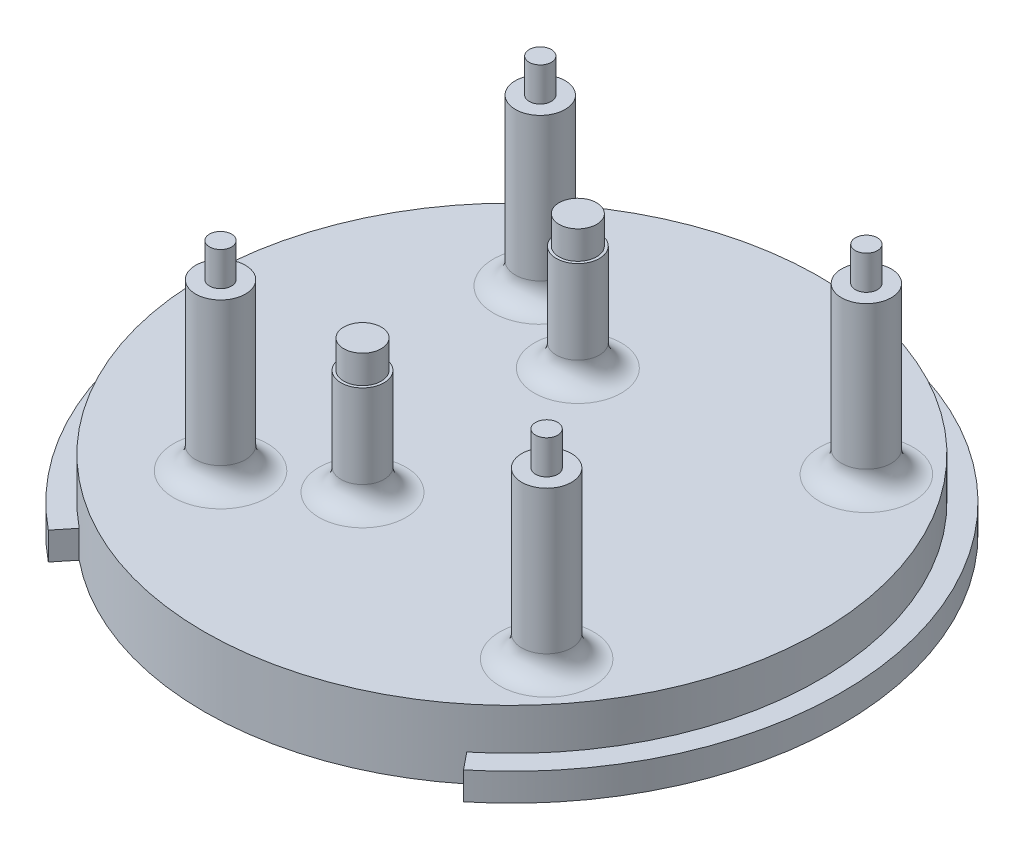
ISO-10303-21;
HEADER;
FILE_DESCRIPTION(('STEP AP214'),'2;1');
FILE_NAME('part.step','',(''),(''),'','','');
FILE_SCHEMA(('AUTOMOTIVE_DESIGN { 1 0 10303 214 1 1 1 1 }'));
ENDSEC;
DATA;
#1=APPLICATION_CONTEXT('core data for automotive mechanical design processes');
#2=APPLICATION_PROTOCOL_DEFINITION('international standard','automotive_design',2000,#1);
#3=PRODUCT_CONTEXT('',#1,'mechanical');
#4=PRODUCT('Part','Part','',(#3));
#5=PRODUCT_RELATED_PRODUCT_CATEGORY('part','',(#4));
#6=PRODUCT_DEFINITION_FORMATION('','',#4);
#7=PRODUCT_DEFINITION_CONTEXT('part definition',#1,'design');
#8=PRODUCT_DEFINITION('design','',#6,#7);
#9=PRODUCT_DEFINITION_SHAPE('','',#8);
#10=(LENGTH_UNIT() NAMED_UNIT(*) SI_UNIT(.MILLI.,.METRE.));
#11=(NAMED_UNIT(*) PLANE_ANGLE_UNIT() SI_UNIT($,.RADIAN.));
#12=(NAMED_UNIT(*) SI_UNIT($,.STERADIAN.) SOLID_ANGLE_UNIT());
#13=UNCERTAINTY_MEASURE_WITH_UNIT(LENGTH_MEASURE(1.E-05),#10,'distance_accuracy_value','');
#14=(GEOMETRIC_REPRESENTATION_CONTEXT(3) GLOBAL_UNCERTAINTY_ASSIGNED_CONTEXT((#13)) GLOBAL_UNIT_ASSIGNED_CONTEXT((#10,
#11,#12)) REPRESENTATION_CONTEXT('',''));
#15=CARTESIAN_POINT('',(0.,0.,0.));
#16=DIRECTION('',(0.,0.,1.));
#17=DIRECTION('',(1.,0.,0.));
#18=AXIS2_PLACEMENT_3D('',#15,#16,#17);
#19=CARTESIAN_POINT('',(0.,2.,0.));
#20=DIRECTION('',(0.,-1.,0.));
#21=DIRECTION('',(0.,0.,-1.));
#22=AXIS2_PLACEMENT_3D('',#19,#20,#21);
#23=CYLINDRICAL_SURFACE('',#22,23.8125);
#24=CARTESIAN_POINT('',(0.,0.,0.));
#25=DIRECTION('',(0.,1.,0.));
#26=DIRECTION('',(0.,0.,1.));
#27=AXIS2_PLACEMENT_3D('',#24,#25,#26);
#28=CIRCLE('',#27,23.8125);
#29=CARTESIAN_POINT('',(15.,0.,18.4941925006203));
#30=VERTEX_POINT('',#29);
#31=CARTESIAN_POINT('',(-15.,0.,18.4941925006203));
#32=VERTEX_POINT('',#31);
#33=EDGE_CURVE('E96',#30,#32,#28,.T.);
#34=ORIENTED_EDGE('',*,*,#33,.T.);
#35=DIRECTION('',(0.,1.,0.));
#36=VECTOR('',#35,1.);
#37=CARTESIAN_POINT('',(-15.,0.,18.4941925006203));
#38=LINE('',#37,#36);
#39=CARTESIAN_POINT('',(-15.,2.,18.4941925006203));
#40=VERTEX_POINT('',#39);
#41=EDGE_CURVE('E58',#32,#40,#38,.T.);
#42=ORIENTED_EDGE('',*,*,#41,.T.);
#43=CARTESIAN_POINT('',(0.,2.,0.));
#44=DIRECTION('',(0.,1.,0.));
#45=DIRECTION('',(0.,0.,1.));
#46=AXIS2_PLACEMENT_3D('',#43,#44,#45);
#47=CIRCLE('',#46,23.8125);
#48=CARTESIAN_POINT('',(15.,2.,18.4941925006203));
#49=VERTEX_POINT('',#48);
#50=EDGE_CURVE('E114',#49,#40,#47,.T.);
#51=ORIENTED_EDGE('',*,*,#50,.F.);
#52=DIRECTION('',(0.,1.,0.));
#53=VECTOR('',#52,1.);
#54=CARTESIAN_POINT('',(15.,0.,18.4941925006203));
#55=LINE('',#54,#53);
#56=EDGE_CURVE('E85',#30,#49,#55,.T.);
#57=ORIENTED_EDGE('',*,*,#56,.F.);
#58=EDGE_LOOP('',(#34,#42,#51,#57));
#59=FACE_BOUND('',#58,.T.);
#60=ADVANCED_FACE('F34',(#59),#23,.T.);
#61=CARTESIAN_POINT('',(0.,2.,0.));
#62=DIRECTION('',(0.,1.,0.));
#63=DIRECTION('',(0.,0.,1.));
#64=AXIS2_PLACEMENT_3D('',#61,#62,#63);
#65=PLANE('',#64);
#66=DIRECTION('',(-0.629921259842522,0.,0.776659002650719));
#67=VECTOR('',#66,1.);
#68=CARTESIAN_POINT('',(-15.,2.,18.4941925006203));
#69=LINE('',#68,#67);
#70=CARTESIAN_POINT('',(-14.,2.,17.2612463339123));
#71=VERTEX_POINT('',#70);
#72=EDGE_CURVE('E72',#71,#40,#69,.T.);
#73=ORIENTED_EDGE('',*,*,#72,.F.);
#74=CARTESIAN_POINT('',(0.,2.,0.));
#75=DIRECTION('',(0.,1.,0.));
#76=DIRECTION('',(0.,0.,1.));
#77=AXIS2_PLACEMENT_3D('',#74,#75,#76);
#78=CIRCLE('',#77,22.225);
#79=CARTESIAN_POINT('',(14.,2.,17.2612463339123));
#80=VERTEX_POINT('',#79);
#81=EDGE_CURVE('E111',#80,#71,#78,.T.);
#82=ORIENTED_EDGE('',*,*,#81,.F.);
#83=DIRECTION('',(-0.629921259842522,0.,-0.776659002650719));
#84=VECTOR('',#83,1.);
#85=CARTESIAN_POINT('',(15.,2.,18.4941925006203));
#86=LINE('',#85,#84);
#87=EDGE_CURVE('E49',#49,#80,#86,.T.);
#88=ORIENTED_EDGE('',*,*,#87,.F.);
#89=ORIENTED_EDGE('',*,*,#50,.T.);
#90=EDGE_LOOP('',(#73,#82,#88,#89));
#91=FACE_BOUND('',#90,.T.);
#92=ADVANCED_FACE('F168',(#91),#65,.T.);
#93=CARTESIAN_POINT('',(0.,0.,0.));
#94=DIRECTION('',(0.,1.,0.));
#95=DIRECTION('',(0.,0.,1.));
#96=AXIS2_PLACEMENT_3D('',#93,#94,#95);
#97=PLANE('',#96);
#98=CARTESIAN_POINT('',(0.,0.,0.));
#99=DIRECTION('',(0.,-1.,0.));
#100=DIRECTION('',(0.,0.,1.));
#101=AXIS2_PLACEMENT_3D('',#98,#99,#100);
#102=CIRCLE('',#101,22.225);
#103=CARTESIAN_POINT('',(14.,0.,17.2612463339123));
#104=VERTEX_POINT('',#103);
#105=CARTESIAN_POINT('',(-14.,0.,17.2612463339123));
#106=VERTEX_POINT('',#105);
#107=EDGE_CURVE('E88',#104,#106,#102,.T.);
#108=ORIENTED_EDGE('',*,*,#107,.T.);
#109=DIRECTION('',(-0.629921259842522,0.,0.776659002650719));
#110=VECTOR('',#109,1.);
#111=CARTESIAN_POINT('',(-15.,0.,18.4941925006203));
#112=LINE('',#111,#110);
#113=EDGE_CURVE('E91',#106,#32,#112,.T.);
#114=ORIENTED_EDGE('',*,*,#113,.T.);
#115=ORIENTED_EDGE('',*,*,#33,.F.);
#116=DIRECTION('',(-0.629921259842522,0.,-0.776659002650719));
#117=VECTOR('',#116,1.);
#118=CARTESIAN_POINT('',(15.,0.,18.4941925006203));
#119=LINE('',#118,#117);
#120=EDGE_CURVE('E76',#30,#104,#119,.T.);
#121=ORIENTED_EDGE('',*,*,#120,.T.);
#122=EDGE_LOOP('',(#108,#114,#115,#121));
#123=FACE_BOUND('',#122,.T.);
#124=ADVANCED_FACE('F94',(#123),#97,.F.);
#125=CARTESIAN_POINT('',(0.,5.,0.));
#126=DIRECTION('',(0.,-1.,0.));
#127=DIRECTION('',(0.,0.,-1.));
#128=AXIS2_PLACEMENT_3D('',#125,#126,#127);
#129=CYLINDRICAL_SURFACE('',#128,22.225);
#130=CARTESIAN_POINT('',(0.,5.,0.));
#131=DIRECTION('',(0.,1.,0.));
#132=DIRECTION('',(0.,0.,1.));
#133=AXIS2_PLACEMENT_3D('',#130,#131,#132);
#134=CIRCLE('',#133,22.225);
#135=CARTESIAN_POINT('',(0.,5.,22.225));
#136=VERTEX_POINT('',#135);
#137=EDGE_CURVE('E106',#136,#136,#134,.T.);
#138=ORIENTED_EDGE('',*,*,#137,.F.);
#139=EDGE_LOOP('',(#138));
#140=FACE_BOUND('',#139,.T.);
#141=ORIENTED_EDGE('',*,*,#81,.T.);
#142=DIRECTION('',(0.,1.,0.));
#143=VECTOR('',#142,1.);
#144=CARTESIAN_POINT('',(-14.,0.,17.2612463339123));
#145=LINE('',#144,#143);
#146=EDGE_CURVE('E84',#106,#71,#145,.T.);
#147=ORIENTED_EDGE('',*,*,#146,.F.);
#148=ORIENTED_EDGE('',*,*,#107,.F.);
#149=DIRECTION('',(0.,1.,0.));
#150=VECTOR('',#149,1.);
#151=CARTESIAN_POINT('',(14.,0.,17.2612463339123));
#152=LINE('',#151,#150);
#153=EDGE_CURVE('E78',#104,#80,#152,.T.);
#154=ORIENTED_EDGE('',*,*,#153,.T.);
#155=EDGE_LOOP('',(#141,#147,#148,#154));
#156=FACE_BOUND('',#155,.T.);
#157=ADVANCED_FACE('F89',(#140,#156),#129,.T.);
#158=CARTESIAN_POINT('',(0.,5.,0.));
#159=DIRECTION('',(0.,1.,0.));
#160=DIRECTION('',(0.,0.,1.));
#161=AXIS2_PLACEMENT_3D('',#158,#159,#160);
#162=PLANE('',#161);
#163=CARTESIAN_POINT('',(14.06,5.,-11.55));
#164=DIRECTION('',(0.,1.,0.));
#165=DIRECTION('',(0.,0.,1.));
#166=AXIS2_PLACEMENT_3D('',#163,#164,#165);
#167=CIRCLE('',#166,3.3875);
#168=CARTESIAN_POINT('',(14.06,5.,-8.16250000000002));
#169=VERTEX_POINT('',#168);
#170=EDGE_CURVE('E137',#169,#169,#167,.F.);
#171=ORIENTED_EDGE('',*,*,#170,.T.);
#172=EDGE_LOOP('',(#171));
#173=FACE_BOUND('',#172,.T.);
#174=CARTESIAN_POINT('',(14.06,5.,11.55));
#175=DIRECTION('',(0.,1.,0.));
#176=DIRECTION('',(0.,0.,1.));
#177=AXIS2_PLACEMENT_3D('',#174,#175,#176);
#178=CIRCLE('',#177,3.3875);
#179=CARTESIAN_POINT('',(14.06,5.,14.9375));
#180=VERTEX_POINT('',#179);
#181=EDGE_CURVE('E134',#180,#180,#178,.F.);
#182=ORIENTED_EDGE('',*,*,#181,.T.);
#183=EDGE_LOOP('',(#182));
#184=FACE_BOUND('',#183,.T.);
#185=CARTESIAN_POINT('',(-3.01475000000002,5.,7.77874999999997));
#186=DIRECTION('',(0.,1.,0.));
#187=DIRECTION('',(0.,0.,1.));
#188=AXIS2_PLACEMENT_3D('',#185,#186,#187);
#189=CIRCLE('',#188,3.14325);
#190=CARTESIAN_POINT('',(-3.01475000000002,5.,10.922));
#191=VERTEX_POINT('',#190);
#192=EDGE_CURVE('E131',#191,#191,#189,.F.);
#193=ORIENTED_EDGE('',*,*,#192,.T.);
#194=EDGE_LOOP('',(#193));
#195=FACE_BOUND('',#194,.T.);
#196=CARTESIAN_POINT('',(-3.01475000000002,5.,-7.77875000000002));
#197=DIRECTION('',(0.,1.,0.));
#198=DIRECTION('',(0.,0.,1.));
#199=AXIS2_PLACEMENT_3D('',#196,#197,#198);
#200=CIRCLE('',#199,3.14325);
#201=CARTESIAN_POINT('',(-3.01475000000002,5.,-4.63550000000003));
#202=VERTEX_POINT('',#201);
#203=EDGE_CURVE('E128',#202,#202,#200,.F.);
#204=ORIENTED_EDGE('',*,*,#203,.T.);
#205=EDGE_LOOP('',(#204));
#206=FACE_BOUND('',#205,.T.);
#207=CARTESIAN_POINT('',(-9.50000000000001,5.,-11.55));
#208=DIRECTION('',(0.,1.,0.));
#209=DIRECTION('',(0.,0.,1.));
#210=AXIS2_PLACEMENT_3D('',#207,#208,#209);
#211=CIRCLE('',#210,3.3875);
#212=CARTESIAN_POINT('',(-9.50000000000001,5.,-8.16250000000003));
#213=VERTEX_POINT('',#212);
#214=EDGE_CURVE('E125',#213,#213,#211,.F.);
#215=ORIENTED_EDGE('',*,*,#214,.T.);
#216=EDGE_LOOP('',(#215));
#217=FACE_BOUND('',#216,.T.);
#218=CARTESIAN_POINT('',(-9.50000000000001,5.,11.55));
#219=DIRECTION('',(0.,1.,0.));
#220=DIRECTION('',(0.,0.,1.));
#221=AXIS2_PLACEMENT_3D('',#218,#219,#220);
#222=CIRCLE('',#221,3.3875);
#223=CARTESIAN_POINT('',(-9.50000000000001,5.,14.9375));
#224=VERTEX_POINT('',#223);
#225=EDGE_CURVE('E121',#224,#224,#222,.F.);
#226=ORIENTED_EDGE('',*,*,#225,.T.);
#227=EDGE_LOOP('',(#226));
#228=FACE_BOUND('',#227,.T.);
#229=ORIENTED_EDGE('',*,*,#137,.T.);
#230=EDGE_LOOP('',(#229));
#231=FACE_BOUND('',#230,.T.);
#232=ADVANCED_FACE('F243',(#173,#184,#195,#206,#217,#228,#231),#162,.T.);
#233=CARTESIAN_POINT('',(-15.,0.,18.4941925006203));
#234=DIRECTION('',(-0.776659002650719,0.,-0.629921259842522));
#235=DIRECTION('',(-0.629921259842522,0.,0.77665900265072));
#236=AXIS2_PLACEMENT_3D('',#233,#234,#235);
#237=PLANE('',#236);
#238=ORIENTED_EDGE('',*,*,#72,.T.);
#239=ORIENTED_EDGE('',*,*,#41,.F.);
#240=ORIENTED_EDGE('',*,*,#113,.F.);
#241=ORIENTED_EDGE('',*,*,#146,.T.);
#242=EDGE_LOOP('',(#238,#239,#240,#241));
#243=FACE_BOUND('',#242,.T.);
#244=ADVANCED_FACE('F240',(#243),#237,.F.);
#245=CARTESIAN_POINT('',(15.,0.,18.4941925006203));
#246=DIRECTION('',(0.776659002650719,0.,-0.629921259842522));
#247=DIRECTION('',(-0.629921259842522,0.,-0.77665900265072));
#248=AXIS2_PLACEMENT_3D('',#245,#246,#247);
#249=PLANE('',#248);
#250=ORIENTED_EDGE('',*,*,#87,.T.);
#251=ORIENTED_EDGE('',*,*,#153,.F.);
#252=ORIENTED_EDGE('',*,*,#120,.F.);
#253=ORIENTED_EDGE('',*,*,#56,.T.);
#254=EDGE_LOOP('',(#250,#251,#252,#253));
#255=FACE_BOUND('',#254,.T.);
#256=ADVANCED_FACE('F80',(#255),#249,.F.);
#257=CARTESIAN_POINT('',(-9.50000000000001,22.0411688245432,-11.55));
#258=DIRECTION('',(0.,-1.,0.));
#259=DIRECTION('',(0.,0.,-1.));
#260=AXIS2_PLACEMENT_3D('',#257,#258,#259);
#261=CYLINDRICAL_SURFACE('',#260,1.8);
#262=CARTESIAN_POINT('',(-9.50000000000001,6.5875,-11.55));
#263=DIRECTION('',(0.,1.,0.));
#264=DIRECTION('',(0.,0.,1.));
#265=AXIS2_PLACEMENT_3D('',#262,#263,#264);
#266=CIRCLE('',#265,1.8);
#267=CARTESIAN_POINT('',(-9.50000000000001,6.5875,-9.75000000000003));
#268=VERTEX_POINT('',#267);
#269=EDGE_CURVE('E42',#268,#268,#266,.T.);
#270=ORIENTED_EDGE('',*,*,#269,.T.);
#271=EDGE_LOOP('',(#270));
#272=FACE_BOUND('',#271,.T.);
#273=CARTESIAN_POINT('',(-9.50000000000001,16.95,-11.55));
#274=DIRECTION('',(0.,-1.,0.));
#275=DIRECTION('',(0.,0.,-1.));
#276=AXIS2_PLACEMENT_3D('',#273,#274,#275);
#277=CIRCLE('',#276,1.8);
#278=CARTESIAN_POINT('',(-9.50000000000001,16.95,-13.35));
#279=VERTEX_POINT('',#278);
#280=EDGE_CURVE('E100',#279,#279,#277,.T.);
#281=ORIENTED_EDGE('',*,*,#280,.T.);
#282=EDGE_LOOP('',(#281));
#283=FACE_BOUND('',#282,.T.);
#284=ADVANCED_FACE('F151',(#272,#283),#261,.T.);
#285=CARTESIAN_POINT('',(0.559999999999992,16.95,0.));
#286=DIRECTION('',(0.,-1.,0.));
#287=DIRECTION('',(0.,0.,1.));
#288=AXIS2_PLACEMENT_3D('',#285,#286,#287);
#289=PLANE('',#288);
#290=CARTESIAN_POINT('',(-9.50000000000001,16.95,-11.55));
#291=DIRECTION('',(0.,1.,0.));
#292=DIRECTION('',(0.,0.,1.));
#293=AXIS2_PLACEMENT_3D('',#290,#291,#292);
#294=CIRCLE('',#293,0.800000000000002);
#295=CARTESIAN_POINT('',(-9.50000000000001,16.95,-10.75));
#296=VERTEX_POINT('',#295);
#297=EDGE_CURVE('E113',#296,#296,#294,.T.);
#298=ORIENTED_EDGE('',*,*,#297,.F.);
#299=EDGE_LOOP('',(#298));
#300=FACE_BOUND('',#299,.T.);
#301=ORIENTED_EDGE('',*,*,#280,.F.);
#302=EDGE_LOOP('',(#301));
#303=FACE_BOUND('',#302,.T.);
#304=ADVANCED_FACE('F224',(#300,#303),#289,.F.);
#305=CARTESIAN_POINT('',(-9.50000000000001,22.0411688245432,11.55));
#306=DIRECTION('',(0.,-1.,0.));
#307=DIRECTION('',(0.,0.,-1.));
#308=AXIS2_PLACEMENT_3D('',#305,#306,#307);
#309=CYLINDRICAL_SURFACE('',#308,1.8);
#310=CARTESIAN_POINT('',(-9.50000000000001,6.5875,11.55));
#311=DIRECTION('',(0.,1.,0.));
#312=DIRECTION('',(0.,0.,1.));
#313=AXIS2_PLACEMENT_3D('',#310,#311,#312);
#314=CIRCLE('',#313,1.8);
#315=CARTESIAN_POINT('',(-9.50000000000001,6.5875,13.35));
#316=VERTEX_POINT('',#315);
#317=EDGE_CURVE('E11',#316,#316,#314,.T.);
#318=ORIENTED_EDGE('',*,*,#317,.T.);
#319=EDGE_LOOP('',(#318));
#320=FACE_BOUND('',#319,.T.);
#321=CARTESIAN_POINT('',(-9.50000000000001,16.95,11.55));
#322=DIRECTION('',(0.,-1.,0.));
#323=DIRECTION('',(0.,0.,-1.));
#324=AXIS2_PLACEMENT_3D('',#321,#322,#323);
#325=CIRCLE('',#324,1.8);
#326=CARTESIAN_POINT('',(-9.50000000000001,16.95,9.74999999999997));
#327=VERTEX_POINT('',#326);
#328=EDGE_CURVE('E217',#327,#327,#325,.T.);
#329=ORIENTED_EDGE('',*,*,#328,.T.);
#330=EDGE_LOOP('',(#329));
#331=FACE_BOUND('',#330,.T.);
#332=ADVANCED_FACE('F226',(#320,#331),#309,.T.);
#333=CARTESIAN_POINT('',(0.559999999999992,16.95,0.));
#334=DIRECTION('',(0.,-1.,0.));
#335=DIRECTION('',(0.,0.,1.));
#336=AXIS2_PLACEMENT_3D('',#333,#334,#335);
#337=PLANE('',#336);
#338=CARTESIAN_POINT('',(-9.50000000000001,16.95,11.55));
#339=DIRECTION('',(0.,1.,0.));
#340=DIRECTION('',(0.,0.,1.));
#341=AXIS2_PLACEMENT_3D('',#338,#339,#340);
#342=CIRCLE('',#341,0.800000000000002);
#343=CARTESIAN_POINT('',(-9.50000000000001,16.95,12.35));
#344=VERTEX_POINT('',#343);
#345=EDGE_CURVE('E500',#344,#344,#342,.T.);
#346=ORIENTED_EDGE('',*,*,#345,.F.);
#347=EDGE_LOOP('',(#346));
#348=FACE_BOUND('',#347,.T.);
#349=ORIENTED_EDGE('',*,*,#328,.F.);
#350=EDGE_LOOP('',(#349));
#351=FACE_BOUND('',#350,.T.);
#352=ADVANCED_FACE('F233',(#348,#351),#337,.F.);
#353=CARTESIAN_POINT('',(14.06,22.0411688245432,11.55));
#354=DIRECTION('',(0.,-1.,0.));
#355=DIRECTION('',(0.,0.,-1.));
#356=AXIS2_PLACEMENT_3D('',#353,#354,#355);
#357=CYLINDRICAL_SURFACE('',#356,1.8);
#358=CARTESIAN_POINT('',(14.06,6.5875,11.55));
#359=DIRECTION('',(0.,1.,0.));
#360=DIRECTION('',(0.,0.,1.));
#361=AXIS2_PLACEMENT_3D('',#358,#359,#360);
#362=CIRCLE('',#361,1.8);
#363=CARTESIAN_POINT('',(14.06,6.5875,13.35));
#364=VERTEX_POINT('',#363);
#365=EDGE_CURVE('E140',#364,#364,#362,.T.);
#366=ORIENTED_EDGE('',*,*,#365,.T.);
#367=EDGE_LOOP('',(#366));
#368=FACE_BOUND('',#367,.T.);
#369=CARTESIAN_POINT('',(14.06,16.95,11.55));
#370=DIRECTION('',(0.,-1.,0.));
#371=DIRECTION('',(0.,0.,-1.));
#372=AXIS2_PLACEMENT_3D('',#369,#370,#371);
#373=CIRCLE('',#372,1.8);
#374=CARTESIAN_POINT('',(14.06,16.95,9.74999999999998));
#375=VERTEX_POINT('',#374);
#376=EDGE_CURVE('E209',#375,#375,#373,.T.);
#377=ORIENTED_EDGE('',*,*,#376,.T.);
#378=EDGE_LOOP('',(#377));
#379=FACE_BOUND('',#378,.T.);
#380=ADVANCED_FACE('F307',(#368,#379),#357,.T.);
#381=CARTESIAN_POINT('',(0.559999999999992,16.95,0.));
#382=DIRECTION('',(0.,-1.,0.));
#383=DIRECTION('',(0.,0.,1.));
#384=AXIS2_PLACEMENT_3D('',#381,#382,#383);
#385=PLANE('',#384);
#386=CARTESIAN_POINT('',(14.06,16.95,11.55));
#387=DIRECTION('',(0.,1.,0.));
#388=DIRECTION('',(0.,0.,1.));
#389=AXIS2_PLACEMENT_3D('',#386,#387,#388);
#390=CIRCLE('',#389,0.800000000000002);
#391=CARTESIAN_POINT('',(14.06,16.95,12.35));
#392=VERTEX_POINT('',#391);
#393=EDGE_CURVE('E504',#392,#392,#390,.T.);
#394=ORIENTED_EDGE('',*,*,#393,.F.);
#395=EDGE_LOOP('',(#394));
#396=FACE_BOUND('',#395,.T.);
#397=ORIENTED_EDGE('',*,*,#376,.F.);
#398=EDGE_LOOP('',(#397));
#399=FACE_BOUND('',#398,.T.);
#400=ADVANCED_FACE('F312',(#396,#399),#385,.F.);
#401=CARTESIAN_POINT('',(14.06,22.0411688245432,-11.55));
#402=DIRECTION('',(0.,-1.,0.));
#403=DIRECTION('',(0.,0.,-1.));
#404=AXIS2_PLACEMENT_3D('',#401,#402,#403);
#405=CYLINDRICAL_SURFACE('',#404,1.8);
#406=CARTESIAN_POINT('',(14.06,6.5875,-11.55));
#407=DIRECTION('',(0.,1.,0.));
#408=DIRECTION('',(0.,0.,1.));
#409=AXIS2_PLACEMENT_3D('',#406,#407,#408);
#410=CIRCLE('',#409,1.8);
#411=CARTESIAN_POINT('',(14.06,6.5875,-9.75000000000002));
#412=VERTEX_POINT('',#411);
#413=EDGE_CURVE('E118',#412,#412,#410,.T.);
#414=ORIENTED_EDGE('',*,*,#413,.T.);
#415=EDGE_LOOP('',(#414));
#416=FACE_BOUND('',#415,.T.);
#417=CARTESIAN_POINT('',(14.06,16.95,-11.55));
#418=DIRECTION('',(0.,-1.,0.));
#419=DIRECTION('',(0.,0.,-1.));
#420=AXIS2_PLACEMENT_3D('',#417,#418,#419);
#421=CIRCLE('',#420,1.8);
#422=CARTESIAN_POINT('',(14.06,16.95,-13.35));
#423=VERTEX_POINT('',#422);
#424=EDGE_CURVE('E205',#423,#423,#421,.T.);
#425=ORIENTED_EDGE('',*,*,#424,.T.);
#426=EDGE_LOOP('',(#425));
#427=FACE_BOUND('',#426,.T.);
#428=ADVANCED_FACE('F320',(#416,#427),#405,.T.);
#429=CARTESIAN_POINT('',(0.559999999999992,16.95,0.));
#430=DIRECTION('',(0.,-1.,0.));
#431=DIRECTION('',(0.,0.,1.));
#432=AXIS2_PLACEMENT_3D('',#429,#430,#431);
#433=PLANE('',#432);
#434=CARTESIAN_POINT('',(14.06,16.95,-11.55));
#435=DIRECTION('',(0.,1.,0.));
#436=DIRECTION('',(0.,0.,1.));
#437=AXIS2_PLACEMENT_3D('',#434,#435,#436);
#438=CIRCLE('',#437,0.800000000000002);
#439=CARTESIAN_POINT('',(14.06,16.95,-10.75));
#440=VERTEX_POINT('',#439);
#441=EDGE_CURVE('E501',#440,#440,#438,.T.);
#442=ORIENTED_EDGE('',*,*,#441,.F.);
#443=EDGE_LOOP('',(#442));
#444=FACE_BOUND('',#443,.T.);
#445=ORIENTED_EDGE('',*,*,#424,.F.);
#446=EDGE_LOOP('',(#445));
#447=FACE_BOUND('',#446,.T.);
#448=ADVANCED_FACE('F199',(#444,#447),#433,.F.);
#449=CARTESIAN_POINT('',(-3.01475000000002,17.0323254993239,7.77874999999997));
#450=DIRECTION('',(0.,-1.,0.));
#451=DIRECTION('',(0.,0.,-1.));
#452=AXIS2_PLACEMENT_3D('',#449,#450,#451);
#453=CYLINDRICAL_SURFACE('',#452,1.55575);
#454=CARTESIAN_POINT('',(-3.01475000000002,6.5875,7.77874999999997));
#455=DIRECTION('',(0.,1.,0.));
#456=DIRECTION('',(0.,0.,1.));
#457=AXIS2_PLACEMENT_3D('',#454,#455,#456);
#458=CIRCLE('',#457,1.55575);
#459=CARTESIAN_POINT('',(-3.01475000000002,6.5875,9.33449999999997));
#460=VERTEX_POINT('',#459);
#461=EDGE_CURVE('E143',#460,#460,#458,.T.);
#462=ORIENTED_EDGE('',*,*,#461,.T.);
#463=EDGE_LOOP('',(#462));
#464=FACE_BOUND('',#463,.T.);
#465=CARTESIAN_POINT('',(-3.01475000000002,12.632,7.77874999999997));
#466=DIRECTION('',(0.,1.,0.));
#467=DIRECTION('',(0.,0.,1.));
#468=AXIS2_PLACEMENT_3D('',#465,#466,#467);
#469=CIRCLE('',#468,1.55575);
#470=CARTESIAN_POINT('',(-3.01475000000002,12.632,9.33449999999997));
#471=VERTEX_POINT('',#470);
#472=EDGE_CURVE('E203',#471,#471,#469,.T.);
#473=ORIENTED_EDGE('',*,*,#472,.F.);
#474=EDGE_LOOP('',(#473));
#475=FACE_BOUND('',#474,.T.);
#476=ADVANCED_FACE('F195',(#464,#475),#453,.T.);
#477=CARTESIAN_POINT('',(2.22399999999998,12.632,0.));
#478=DIRECTION('',(0.,1.,0.));
#479=DIRECTION('',(1.,0.,0.));
#480=AXIS2_PLACEMENT_3D('',#477,#478,#479);
#481=PLANE('',#480);
#482=CARTESIAN_POINT('',(-3.01475000000002,12.632,7.77874999999997));
#483=DIRECTION('',(0.,1.,0.));
#484=DIRECTION('',(0.,0.,1.));
#485=AXIS2_PLACEMENT_3D('',#482,#483,#484);
#486=CIRCLE('',#485,1.35575);
#487=CARTESIAN_POINT('',(-3.01475000000002,12.632,9.13449999999997));
#488=VERTEX_POINT('',#487);
#489=EDGE_CURVE('E122',#488,#488,#486,.T.);
#490=ORIENTED_EDGE('',*,*,#489,.F.);
#491=EDGE_LOOP('',(#490));
#492=FACE_BOUND('',#491,.T.);
#493=ORIENTED_EDGE('',*,*,#472,.T.);
#494=EDGE_LOOP('',(#493));
#495=FACE_BOUND('',#494,.T.);
#496=ADVANCED_FACE('F198',(#492,#495),#481,.T.);
#497=CARTESIAN_POINT('',(-3.01475000000002,17.0323254993239,-7.77875000000002));
#498=DIRECTION('',(0.,-1.,0.));
#499=DIRECTION('',(0.,0.,-1.));
#500=AXIS2_PLACEMENT_3D('',#497,#498,#499);
#501=CYLINDRICAL_SURFACE('',#500,1.55575);
#502=CARTESIAN_POINT('',(-3.01475000000002,6.5875,-7.77875000000002));
#503=DIRECTION('',(0.,1.,0.));
#504=DIRECTION('',(0.,0.,1.));
#505=AXIS2_PLACEMENT_3D('',#502,#503,#504);
#506=CIRCLE('',#505,1.55575);
#507=CARTESIAN_POINT('',(-3.01475000000002,6.5875,-6.22300000000003));
#508=VERTEX_POINT('',#507);
#509=EDGE_CURVE('E146',#508,#508,#506,.T.);
#510=ORIENTED_EDGE('',*,*,#509,.T.);
#511=EDGE_LOOP('',(#510));
#512=FACE_BOUND('',#511,.T.);
#513=CARTESIAN_POINT('',(-3.01475000000002,12.632,-7.77875000000002));
#514=DIRECTION('',(0.,1.,0.));
#515=DIRECTION('',(0.,0.,1.));
#516=AXIS2_PLACEMENT_3D('',#513,#514,#515);
#517=CIRCLE('',#516,1.55575);
#518=CARTESIAN_POINT('',(-3.01475000000002,12.632,-6.22300000000003));
#519=VERTEX_POINT('',#518);
#520=EDGE_CURVE('E206',#519,#519,#517,.T.);
#521=ORIENTED_EDGE('',*,*,#520,.F.);
#522=EDGE_LOOP('',(#521));
#523=FACE_BOUND('',#522,.T.);
#524=ADVANCED_FACE('F340',(#512,#523),#501,.T.);
#525=CARTESIAN_POINT('',(2.22399999999998,12.632,0.));
#526=DIRECTION('',(0.,1.,0.));
#527=DIRECTION('',(1.,0.,0.));
#528=AXIS2_PLACEMENT_3D('',#525,#526,#527);
#529=PLANE('',#528);
#530=CARTESIAN_POINT('',(-3.01475000000002,12.632,-7.77875000000002));
#531=DIRECTION('',(0.,1.,0.));
#532=DIRECTION('',(0.,0.,1.));
#533=AXIS2_PLACEMENT_3D('',#530,#531,#532);
#534=CIRCLE('',#533,1.35575);
#535=CARTESIAN_POINT('',(-3.01475000000002,12.632,-6.42300000000003));
#536=VERTEX_POINT('',#535);
#537=EDGE_CURVE('E529',#536,#536,#534,.T.);
#538=ORIENTED_EDGE('',*,*,#537,.F.);
#539=EDGE_LOOP('',(#538));
#540=FACE_BOUND('',#539,.T.);
#541=ORIENTED_EDGE('',*,*,#520,.T.);
#542=EDGE_LOOP('',(#541));
#543=FACE_BOUND('',#542,.T.);
#544=ADVANCED_FACE('F345',(#540,#543),#529,.T.);
#545=CARTESIAN_POINT('',(-9.50000000000001,21.662741699797,-11.55));
#546=DIRECTION('',(0.,-1.,0.));
#547=DIRECTION('',(0.,0.,-1.));
#548=AXIS2_PLACEMENT_3D('',#545,#546,#547);
#549=CYLINDRICAL_SURFACE('',#548,0.800000000000002);
#550=ORIENTED_EDGE('',*,*,#297,.T.);
#551=EDGE_LOOP('',(#550));
#552=FACE_BOUND('',#551,.T.);
#553=CARTESIAN_POINT('',(-9.50000000000001,19.4,-11.55));
#554=DIRECTION('',(0.,1.,0.));
#555=DIRECTION('',(0.,0.,1.));
#556=AXIS2_PLACEMENT_3D('',#553,#554,#555);
#557=CIRCLE('',#556,0.800000000000002);
#558=CARTESIAN_POINT('',(-9.50000000000001,19.4,-10.75));
#559=VERTEX_POINT('',#558);
#560=EDGE_CURVE('E212',#559,#559,#557,.T.);
#561=ORIENTED_EDGE('',*,*,#560,.F.);
#562=EDGE_LOOP('',(#561));
#563=FACE_BOUND('',#562,.T.);
#564=ADVANCED_FACE('F465',(#552,#563),#549,.T.);
#565=CARTESIAN_POINT('',(0.,19.4,0.));
#566=DIRECTION('',(0.,1.,0.));
#567=DIRECTION('',(0.818804233798622,0.,0.574072840947428));
#568=AXIS2_PLACEMENT_3D('',#565,#566,#567);
#569=PLANE('',#568);
#570=ORIENTED_EDGE('',*,*,#560,.T.);
#571=EDGE_LOOP('',(#570));
#572=FACE_BOUND('',#571,.T.);
#573=ADVANCED_FACE('F457',(#572),#569,.T.);
#574=CARTESIAN_POINT('',(-9.50000000000001,21.662741699797,11.55));
#575=DIRECTION('',(0.,-1.,0.));
#576=DIRECTION('',(0.,0.,-1.));
#577=AXIS2_PLACEMENT_3D('',#574,#575,#576);
#578=CYLINDRICAL_SURFACE('',#577,0.800000000000002);
#579=ORIENTED_EDGE('',*,*,#345,.T.);
#580=EDGE_LOOP('',(#579));
#581=FACE_BOUND('',#580,.T.);
#582=CARTESIAN_POINT('',(-9.50000000000001,19.4,11.55));
#583=DIRECTION('',(0.,1.,0.));
#584=DIRECTION('',(0.,0.,1.));
#585=AXIS2_PLACEMENT_3D('',#582,#583,#584);
#586=CIRCLE('',#585,0.800000000000002);
#587=CARTESIAN_POINT('',(-9.50000000000001,19.4,12.35));
#588=VERTEX_POINT('',#587);
#589=EDGE_CURVE('E511',#588,#588,#586,.T.);
#590=ORIENTED_EDGE('',*,*,#589,.F.);
#591=EDGE_LOOP('',(#590));
#592=FACE_BOUND('',#591,.T.);
#593=ADVANCED_FACE('F449',(#581,#592),#578,.T.);
#594=CARTESIAN_POINT('',(0.,19.4,0.));
#595=DIRECTION('',(0.,1.,0.));
#596=DIRECTION('',(0.818804233798622,0.,0.574072840947428));
#597=AXIS2_PLACEMENT_3D('',#594,#595,#596);
#598=PLANE('',#597);
#599=ORIENTED_EDGE('',*,*,#589,.T.);
#600=EDGE_LOOP('',(#599));
#601=FACE_BOUND('',#600,.T.);
#602=ADVANCED_FACE('F441',(#601),#598,.T.);
#603=CARTESIAN_POINT('',(14.06,21.662741699797,-11.55));
#604=DIRECTION('',(0.,-1.,0.));
#605=DIRECTION('',(0.,0.,-1.));
#606=AXIS2_PLACEMENT_3D('',#603,#604,#605);
#607=CYLINDRICAL_SURFACE('',#606,0.800000000000002);
#608=ORIENTED_EDGE('',*,*,#441,.T.);
#609=EDGE_LOOP('',(#608));
#610=FACE_BOUND('',#609,.T.);
#611=CARTESIAN_POINT('',(14.06,19.4,-11.55));
#612=DIRECTION('',(0.,1.,0.));
#613=DIRECTION('',(0.,0.,1.));
#614=AXIS2_PLACEMENT_3D('',#611,#612,#613);
#615=CIRCLE('',#614,0.800000000000002);
#616=CARTESIAN_POINT('',(14.06,19.4,-10.75));
#617=VERTEX_POINT('',#616);
#618=EDGE_CURVE('E510',#617,#617,#615,.T.);
#619=ORIENTED_EDGE('',*,*,#618,.F.);
#620=EDGE_LOOP('',(#619));
#621=FACE_BOUND('',#620,.T.);
#622=ADVANCED_FACE('F433',(#610,#621),#607,.T.);
#623=CARTESIAN_POINT('',(0.,19.4,0.));
#624=DIRECTION('',(0.,1.,0.));
#625=DIRECTION('',(0.818804233798622,0.,0.574072840947428));
#626=AXIS2_PLACEMENT_3D('',#623,#624,#625);
#627=PLANE('',#626);
#628=ORIENTED_EDGE('',*,*,#618,.T.);
#629=EDGE_LOOP('',(#628));
#630=FACE_BOUND('',#629,.T.);
#631=ADVANCED_FACE('F425',(#630),#627,.T.);
#632=CARTESIAN_POINT('',(14.06,21.662741699797,11.55));
#633=DIRECTION('',(0.,-1.,0.));
#634=DIRECTION('',(0.,0.,-1.));
#635=AXIS2_PLACEMENT_3D('',#632,#633,#634);
#636=CYLINDRICAL_SURFACE('',#635,0.800000000000002);
#637=ORIENTED_EDGE('',*,*,#393,.T.);
#638=EDGE_LOOP('',(#637));
#639=FACE_BOUND('',#638,.T.);
#640=CARTESIAN_POINT('',(14.06,19.4,11.55));
#641=DIRECTION('',(0.,1.,0.));
#642=DIRECTION('',(0.,0.,1.));
#643=AXIS2_PLACEMENT_3D('',#640,#641,#642);
#644=CIRCLE('',#643,0.800000000000002);
#645=CARTESIAN_POINT('',(14.06,19.4,12.35));
#646=VERTEX_POINT('',#645);
#647=EDGE_CURVE('E518',#646,#646,#644,.T.);
#648=ORIENTED_EDGE('',*,*,#647,.F.);
#649=EDGE_LOOP('',(#648));
#650=FACE_BOUND('',#649,.T.);
#651=ADVANCED_FACE('F416',(#639,#650),#636,.T.);
#652=CARTESIAN_POINT('',(0.,19.4,0.));
#653=DIRECTION('',(0.,1.,0.));
#654=DIRECTION('',(0.818804233798622,0.,0.574072840947428));
#655=AXIS2_PLACEMENT_3D('',#652,#653,#654);
#656=PLANE('',#655);
#657=ORIENTED_EDGE('',*,*,#647,.T.);
#658=EDGE_LOOP('',(#657));
#659=FACE_BOUND('',#658,.T.);
#660=ADVANCED_FACE('F407',(#659),#656,.T.);
#661=CARTESIAN_POINT('',(-3.01475000000002,18.4986400743747,-7.77875000000002));
#662=DIRECTION('',(0.,-1.,0.));
#663=DIRECTION('',(0.,0.,-1.));
#664=AXIS2_PLACEMENT_3D('',#661,#662,#663);
#665=CYLINDRICAL_SURFACE('',#664,1.35575);
#666=ORIENTED_EDGE('',*,*,#537,.T.);
#667=EDGE_LOOP('',(#666));
#668=FACE_BOUND('',#667,.T.);
#669=CARTESIAN_POINT('',(-3.01475000000002,14.664,-7.77875000000002));
#670=DIRECTION('',(0.,1.,0.));
#671=DIRECTION('',(-1.,0.,0.));
#672=AXIS2_PLACEMENT_3D('',#669,#670,#671);
#673=CIRCLE('',#672,1.35575);
#674=CARTESIAN_POINT('',(-4.37050000000002,14.664,-7.77875000000002));
#675=VERTEX_POINT('',#674);
#676=EDGE_CURVE('E521',#675,#675,#673,.T.);
#677=ORIENTED_EDGE('',*,*,#676,.F.);
#678=EDGE_LOOP('',(#677));
#679=FACE_BOUND('',#678,.T.);
#680=ADVANCED_FACE('F399',(#668,#679),#665,.T.);
#681=CARTESIAN_POINT('',(-9.64530017465894,14.6640000000001,4.88172928035009));
#682=DIRECTION('',(0.,1.,0.));
#683=DIRECTION('',(1.,0.,0.));
#684=AXIS2_PLACEMENT_3D('',#681,#682,#683);
#685=PLANE('',#684);
#686=ORIENTED_EDGE('',*,*,#676,.T.);
#687=EDGE_LOOP('',(#686));
#688=FACE_BOUND('',#687,.T.);
#689=ADVANCED_FACE('F391',(#688),#685,.T.);
#690=CARTESIAN_POINT('',(-3.01475000000002,18.4986400743747,7.77874999999997));
#691=DIRECTION('',(0.,-1.,0.));
#692=DIRECTION('',(0.,0.,-1.));
#693=AXIS2_PLACEMENT_3D('',#690,#691,#692);
#694=CYLINDRICAL_SURFACE('',#693,1.35575);
#695=ORIENTED_EDGE('',*,*,#489,.T.);
#696=EDGE_LOOP('',(#695));
#697=FACE_BOUND('',#696,.T.);
#698=CARTESIAN_POINT('',(-3.01475000000002,14.664,7.77874999999997));
#699=DIRECTION('',(0.,1.,0.));
#700=DIRECTION('',(-1.,0.,0.));
#701=AXIS2_PLACEMENT_3D('',#698,#699,#700);
#702=CIRCLE('',#701,1.35575);
#703=CARTESIAN_POINT('',(-4.37050000000002,14.664,7.77874999999997));
#704=VERTEX_POINT('',#703);
#705=EDGE_CURVE('E525',#704,#704,#702,.T.);
#706=ORIENTED_EDGE('',*,*,#705,.F.);
#707=EDGE_LOOP('',(#706));
#708=FACE_BOUND('',#707,.T.);
#709=ADVANCED_FACE('F386',(#697,#708),#694,.T.);
#710=CARTESIAN_POINT('',(-9.64530017465894,14.6640000000001,4.88172928035009));
#711=DIRECTION('',(0.,1.,0.));
#712=DIRECTION('',(1.,0.,0.));
#713=AXIS2_PLACEMENT_3D('',#710,#711,#712);
#714=PLANE('',#713);
#715=ORIENTED_EDGE('',*,*,#705,.T.);
#716=EDGE_LOOP('',(#715));
#717=FACE_BOUND('',#716,.T.);
#718=ADVANCED_FACE('F182',(#717),#714,.T.);
#719=CARTESIAN_POINT('',(14.06,6.5875,-11.55));
#720=DIRECTION('',(0.,1.,0.));
#721=DIRECTION('',(0.,0.,1.));
#722=AXIS2_PLACEMENT_3D('',#719,#720,#721);
#723=TOROIDAL_SURFACE('',#722,3.3875,1.5875);
#724=ORIENTED_EDGE('',*,*,#170,.F.);
#725=EDGE_LOOP('',(#724));
#726=FACE_BOUND('',#725,.T.);
#727=ORIENTED_EDGE('',*,*,#413,.F.);
#728=EDGE_LOOP('',(#727));
#729=FACE_BOUND('',#728,.T.);
#730=ADVANCED_FACE('F178',(#726,#729),#723,.F.);
#731=CARTESIAN_POINT('',(14.06,6.5875,11.55));
#732=DIRECTION('',(0.,1.,0.));
#733=DIRECTION('',(0.,0.,1.));
#734=AXIS2_PLACEMENT_3D('',#731,#732,#733);
#735=TOROIDAL_SURFACE('',#734,3.3875,1.5875);
#736=ORIENTED_EDGE('',*,*,#181,.F.);
#737=EDGE_LOOP('',(#736));
#738=FACE_BOUND('',#737,.T.);
#739=ORIENTED_EDGE('',*,*,#365,.F.);
#740=EDGE_LOOP('',(#739));
#741=FACE_BOUND('',#740,.T.);
#742=ADVANCED_FACE('F181',(#738,#741),#735,.F.);
#743=CARTESIAN_POINT('',(-3.01475000000002,6.5875,7.77874999999997));
#744=DIRECTION('',(0.,1.,0.));
#745=DIRECTION('',(0.,0.,1.));
#746=AXIS2_PLACEMENT_3D('',#743,#744,#745);
#747=TOROIDAL_SURFACE('',#746,3.14325,1.5875);
#748=ORIENTED_EDGE('',*,*,#192,.F.);
#749=EDGE_LOOP('',(#748));
#750=FACE_BOUND('',#749,.T.);
#751=ORIENTED_EDGE('',*,*,#461,.F.);
#752=EDGE_LOOP('',(#751));
#753=FACE_BOUND('',#752,.T.);
#754=ADVANCED_FACE('F163',(#750,#753),#747,.F.);
#755=CARTESIAN_POINT('',(-3.01475000000002,6.5875,-7.77875000000002));
#756=DIRECTION('',(0.,1.,0.));
#757=DIRECTION('',(0.,0.,1.));
#758=AXIS2_PLACEMENT_3D('',#755,#756,#757);
#759=TOROIDAL_SURFACE('',#758,3.14325,1.5875);
#760=ORIENTED_EDGE('',*,*,#203,.F.);
#761=EDGE_LOOP('',(#760));
#762=FACE_BOUND('',#761,.T.);
#763=ORIENTED_EDGE('',*,*,#509,.F.);
#764=EDGE_LOOP('',(#763));
#765=FACE_BOUND('',#764,.T.);
#766=ADVANCED_FACE('F156',(#762,#765),#759,.F.);
#767=CARTESIAN_POINT('',(-9.50000000000001,6.5875,-11.55));
#768=DIRECTION('',(0.,1.,0.));
#769=DIRECTION('',(0.,0.,1.));
#770=AXIS2_PLACEMENT_3D('',#767,#768,#769);
#771=TOROIDAL_SURFACE('',#770,3.3875,1.5875);
#772=ORIENTED_EDGE('',*,*,#214,.F.);
#773=EDGE_LOOP('',(#772));
#774=FACE_BOUND('',#773,.T.);
#775=ORIENTED_EDGE('',*,*,#269,.F.);
#776=EDGE_LOOP('',(#775));
#777=FACE_BOUND('',#776,.T.);
#778=ADVANCED_FACE('F154',(#774,#777),#771,.F.);
#779=CARTESIAN_POINT('',(-9.50000000000001,6.5875,11.55));
#780=DIRECTION('',(0.,1.,0.));
#781=DIRECTION('',(0.,0.,1.));
#782=AXIS2_PLACEMENT_3D('',#779,#780,#781);
#783=TOROIDAL_SURFACE('',#782,3.3875,1.5875);
#784=ORIENTED_EDGE('',*,*,#225,.F.);
#785=EDGE_LOOP('',(#784));
#786=FACE_BOUND('',#785,.T.);
#787=ORIENTED_EDGE('',*,*,#317,.F.);
#788=EDGE_LOOP('',(#787));
#789=FACE_BOUND('',#788,.T.);
#790=ADVANCED_FACE('F36',(#786,#789),#783,.F.);
#791=CLOSED_SHELL('',(#60,#92,#124,#157,#232,#244,#256,#284,#304,#332,#352,#380,#400,#428,#448,
#476,#496,#524,#544,#564,#573,#593,#602,#622,#631,#651,#660,#680,#689,#709,#718,#730,#742,#754,
#766,#778,#790));
#792=MANIFOLD_SOLID_BREP('B2',#791);
#793=ADVANCED_BREP_SHAPE_REPRESENTATION('',(#18,#792),#14);
#794=SHAPE_DEFINITION_REPRESENTATION(#9,#793);
ENDSEC;
END-ISO-10303-21;
